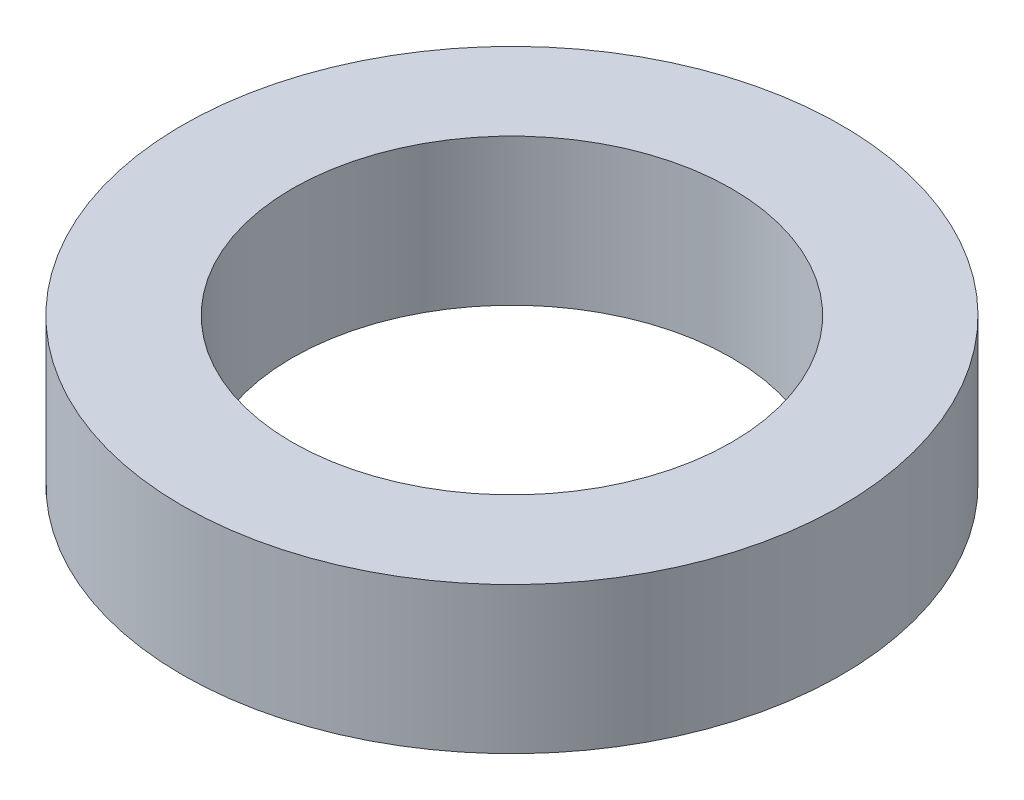
ISO-10303-21;
HEADER;
FILE_DESCRIPTION(('STEP AP214'),'2;1');
FILE_NAME('part.step','',(''),(''),'','','');
FILE_SCHEMA(('AUTOMOTIVE_DESIGN { 1 0 10303 214 1 1 1 1 }'));
ENDSEC;
DATA;
#1=APPLICATION_CONTEXT('core data for automotive mechanical design processes');
#2=APPLICATION_PROTOCOL_DEFINITION('international standard','automotive_design',2000,#1);
#3=PRODUCT_CONTEXT('',#1,'mechanical');
#4=PRODUCT('Part','Part','',(#3));
#5=PRODUCT_RELATED_PRODUCT_CATEGORY('part','',(#4));
#6=PRODUCT_DEFINITION_FORMATION('','',#4);
#7=PRODUCT_DEFINITION_CONTEXT('part definition',#1,'design');
#8=PRODUCT_DEFINITION('design','',#6,#7);
#9=PRODUCT_DEFINITION_SHAPE('','',#8);
#10=(LENGTH_UNIT() NAMED_UNIT(*) SI_UNIT(.MILLI.,.METRE.));
#11=(NAMED_UNIT(*) PLANE_ANGLE_UNIT() SI_UNIT($,.RADIAN.));
#12=(NAMED_UNIT(*) SI_UNIT($,.STERADIAN.) SOLID_ANGLE_UNIT());
#13=UNCERTAINTY_MEASURE_WITH_UNIT(LENGTH_MEASURE(1.E-05),#10,'distance_accuracy_value','');
#14=(GEOMETRIC_REPRESENTATION_CONTEXT(3) GLOBAL_UNCERTAINTY_ASSIGNED_CONTEXT((#13)) GLOBAL_UNIT_ASSIGNED_CONTEXT((#10,
#11,#12)) REPRESENTATION_CONTEXT('',''));
#15=CARTESIAN_POINT('',(0.,0.,0.));
#16=DIRECTION('',(0.,0.,1.));
#17=DIRECTION('',(1.,0.,0.));
#18=AXIS2_PLACEMENT_3D('',#15,#16,#17);
#19=CARTESIAN_POINT('',(0.,10.,0.));
#20=DIRECTION('',(0.,-1.,0.));
#21=DIRECTION('',(0.,0.,-1.));
#22=AXIS2_PLACEMENT_3D('',#19,#20,#21);
#23=CYLINDRICAL_SURFACE('',#22,22.5);
#24=CARTESIAN_POINT('',(0.,10.,0.));
#25=DIRECTION('',(0.,1.,0.));
#26=DIRECTION('',(0.,0.,1.));
#27=AXIS2_PLACEMENT_3D('',#24,#25,#26);
#28=CIRCLE('',#27,22.5);
#29=CARTESIAN_POINT('',(0.,10.,22.5));
#30=VERTEX_POINT('',#29);
#31=EDGE_CURVE('E10',#30,#30,#28,.T.);
#32=ORIENTED_EDGE('',*,*,#31,.F.);
#33=EDGE_LOOP('',(#32));
#34=FACE_BOUND('',#33,.T.);
#35=CARTESIAN_POINT('',(0.,0.,0.));
#36=DIRECTION('',(0.,1.,0.));
#37=DIRECTION('',(0.,0.,1.));
#38=AXIS2_PLACEMENT_3D('',#35,#36,#37);
#39=CIRCLE('',#38,22.5);
#40=CARTESIAN_POINT('',(0.,0.,22.5));
#41=VERTEX_POINT('',#40);
#42=EDGE_CURVE('E37',#41,#41,#39,.T.);
#43=ORIENTED_EDGE('',*,*,#42,.T.);
#44=EDGE_LOOP('',(#43));
#45=FACE_BOUND('',#44,.T.);
#46=ADVANCED_FACE('F40',(#34,#45),#23,.T.);
#47=CARTESIAN_POINT('',(0.,10.,0.));
#48=DIRECTION('',(0.,1.,0.));
#49=DIRECTION('',(0.,0.,1.));
#50=AXIS2_PLACEMENT_3D('',#47,#48,#49);
#51=PLANE('',#50);
#52=CARTESIAN_POINT('',(0.,10.,0.));
#53=DIRECTION('',(0.,1.,0.));
#54=DIRECTION('',(0.,0.,1.));
#55=AXIS2_PLACEMENT_3D('',#52,#53,#54);
#56=CIRCLE('',#55,15.);
#57=CARTESIAN_POINT('',(0.,10.,15.));
#58=VERTEX_POINT('',#57);
#59=EDGE_CURVE('E50',#58,#58,#56,.T.);
#60=ORIENTED_EDGE('',*,*,#59,.F.);
#61=EDGE_LOOP('',(#60));
#62=FACE_BOUND('',#61,.T.);
#63=ORIENTED_EDGE('',*,*,#31,.T.);
#64=EDGE_LOOP('',(#63));
#65=FACE_BOUND('',#64,.T.);
#66=ADVANCED_FACE('F59',(#62,#65),#51,.T.);
#67=CARTESIAN_POINT('',(0.,0.,0.));
#68=DIRECTION('',(0.,1.,0.));
#69=DIRECTION('',(0.,0.,1.));
#70=AXIS2_PLACEMENT_3D('',#67,#68,#69);
#71=PLANE('',#70);
#72=CARTESIAN_POINT('',(0.,0.,0.));
#73=DIRECTION('',(0.,1.,0.));
#74=DIRECTION('',(0.,0.,1.));
#75=AXIS2_PLACEMENT_3D('',#72,#73,#74);
#76=CIRCLE('',#75,15.);
#77=CARTESIAN_POINT('',(0.,0.,15.));
#78=VERTEX_POINT('',#77);
#79=EDGE_CURVE('E47',#78,#78,#76,.T.);
#80=ORIENTED_EDGE('',*,*,#79,.T.);
#81=EDGE_LOOP('',(#80));
#82=FACE_BOUND('',#81,.T.);
#83=ORIENTED_EDGE('',*,*,#42,.F.);
#84=EDGE_LOOP('',(#83));
#85=FACE_BOUND('',#84,.T.);
#86=ADVANCED_FACE('F58',(#82,#85),#71,.F.);
#87=CARTESIAN_POINT('',(0.,10.,0.));
#88=DIRECTION('',(0.,-1.,0.));
#89=DIRECTION('',(0.,0.,-1.));
#90=AXIS2_PLACEMENT_3D('',#87,#88,#89);
#91=CYLINDRICAL_SURFACE('',#90,15.);
#92=ORIENTED_EDGE('',*,*,#59,.T.);
#93=EDGE_LOOP('',(#92));
#94=FACE_BOUND('',#93,.T.);
#95=ORIENTED_EDGE('',*,*,#79,.F.);
#96=EDGE_LOOP('',(#95));
#97=FACE_BOUND('',#96,.T.);
#98=ADVANCED_FACE('F54',(#94,#97),#91,.F.);
#99=CLOSED_SHELL('',(#46,#66,#86,#98));
#100=MANIFOLD_SOLID_BREP('B2',#99);
#101=ADVANCED_BREP_SHAPE_REPRESENTATION('',(#18,#100),#14);
#102=SHAPE_DEFINITION_REPRESENTATION(#9,#101);
ENDSEC;
END-ISO-10303-21;
